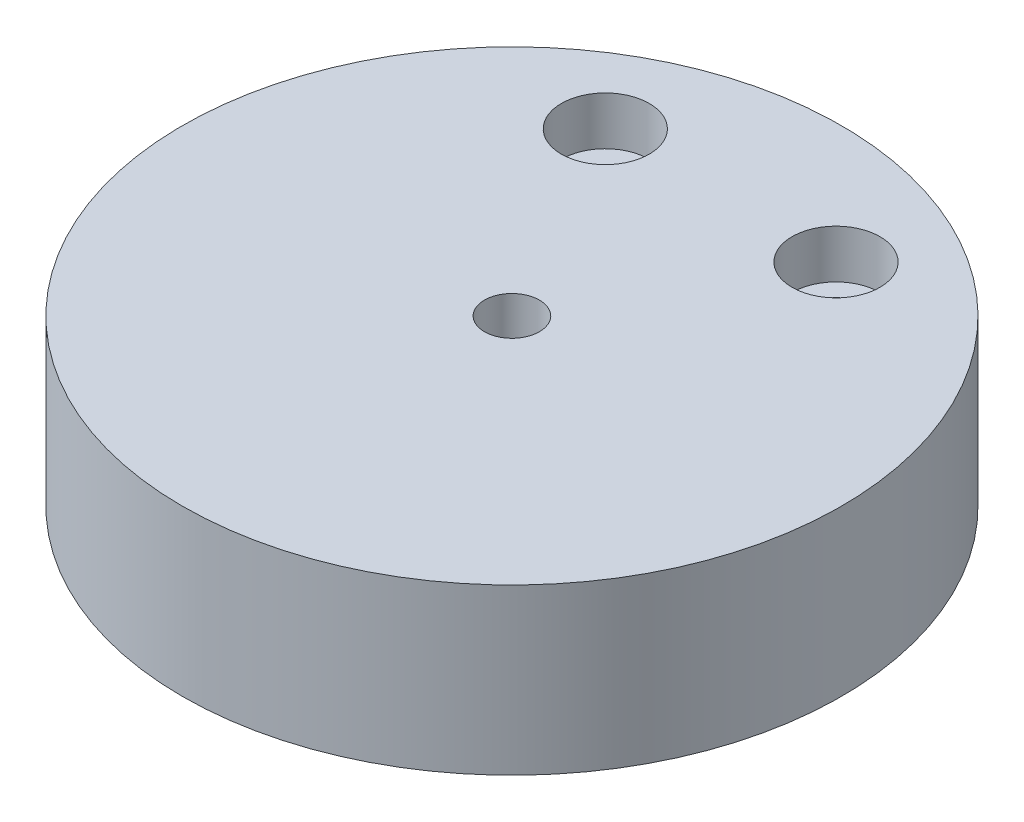
ISO-10303-21;
HEADER;
FILE_DESCRIPTION(('STEP AP214'),'2;1');
FILE_NAME('part.step','',(''),(''),'','','');
FILE_SCHEMA(('AUTOMOTIVE_DESIGN { 1 0 10303 214 1 1 1 1 }'));
ENDSEC;
DATA;
#1=APPLICATION_CONTEXT('core data for automotive mechanical design processes');
#2=APPLICATION_PROTOCOL_DEFINITION('international standard','automotive_design',2000,#1);
#3=PRODUCT_CONTEXT('',#1,'mechanical');
#4=PRODUCT('Part','Part','',(#3));
#5=PRODUCT_RELATED_PRODUCT_CATEGORY('part','',(#4));
#6=PRODUCT_DEFINITION_FORMATION('','',#4);
#7=PRODUCT_DEFINITION_CONTEXT('part definition',#1,'design');
#8=PRODUCT_DEFINITION('design','',#6,#7);
#9=PRODUCT_DEFINITION_SHAPE('','',#8);
#10=(LENGTH_UNIT() NAMED_UNIT(*) SI_UNIT(.MILLI.,.METRE.));
#11=(NAMED_UNIT(*) PLANE_ANGLE_UNIT() SI_UNIT($,.RADIAN.));
#12=(NAMED_UNIT(*) SI_UNIT($,.STERADIAN.) SOLID_ANGLE_UNIT());
#13=UNCERTAINTY_MEASURE_WITH_UNIT(LENGTH_MEASURE(1.E-05),#10,'distance_accuracy_value','');
#14=(GEOMETRIC_REPRESENTATION_CONTEXT(3) GLOBAL_UNCERTAINTY_ASSIGNED_CONTEXT((#13)) GLOBAL_UNIT_ASSIGNED_CONTEXT((#10,
#11,#12)) REPRESENTATION_CONTEXT('',''));
#15=CARTESIAN_POINT('',(0.,0.,0.));
#16=DIRECTION('',(0.,0.,1.));
#17=DIRECTION('',(1.,0.,0.));
#18=AXIS2_PLACEMENT_3D('',#15,#16,#17);
#19=CARTESIAN_POINT('',(121.722144348823,15.,-83.9358310413758));
#20=DIRECTION('',(0.,-1.,0.));
#21=DIRECTION('',(0.,0.,-1.));
#22=AXIS2_PLACEMENT_3D('',#19,#20,#21);
#23=CYLINDRICAL_SURFACE('',#22,30.);
#24=CARTESIAN_POINT('',(121.722144348823,15.,-83.9358310413758));
#25=DIRECTION('',(0.,1.,0.));
#26=DIRECTION('',(0.,0.,1.));
#27=AXIS2_PLACEMENT_3D('',#24,#25,#26);
#28=CIRCLE('',#27,30.);
#29=CARTESIAN_POINT('',(121.722144348823,15.,-53.9358310413758));
#30=VERTEX_POINT('',#29);
#31=EDGE_CURVE('E10',#30,#30,#28,.T.);
#32=ORIENTED_EDGE('',*,*,#31,.F.);
#33=EDGE_LOOP('',(#32));
#34=FACE_BOUND('',#33,.T.);
#35=CARTESIAN_POINT('',(121.722144348823,0.,-83.9358310413758));
#36=DIRECTION('',(0.,1.,0.));
#37=DIRECTION('',(0.,0.,1.));
#38=AXIS2_PLACEMENT_3D('',#35,#36,#37);
#39=CIRCLE('',#38,30.);
#40=CARTESIAN_POINT('',(121.722144348823,0.,-53.9358310413758));
#41=VERTEX_POINT('',#40);
#42=EDGE_CURVE('E36',#41,#41,#39,.T.);
#43=ORIENTED_EDGE('',*,*,#42,.T.);
#44=EDGE_LOOP('',(#43));
#45=FACE_BOUND('',#44,.T.);
#46=ADVANCED_FACE('F33',(#34,#45),#23,.T.);
#47=CARTESIAN_POINT('',(121.722144348823,15.,-83.9358310413758));
#48=DIRECTION('',(0.,1.,0.));
#49=DIRECTION('',(0.,0.,1.));
#50=AXIS2_PLACEMENT_3D('',#47,#48,#49);
#51=PLANE('',#50);
#52=CARTESIAN_POINT('',(132.222144348823,15.,-102.935831041376));
#53=DIRECTION('',(0.,1.,0.));
#54=DIRECTION('',(0.,0.,1.));
#55=AXIS2_PLACEMENT_3D('',#52,#53,#54);
#56=CIRCLE('',#55,4.);
#57=CARTESIAN_POINT('',(132.222144348823,15.,-98.9358310413758));
#58=VERTEX_POINT('',#57);
#59=EDGE_CURVE('E71',#58,#58,#56,.T.);
#60=ORIENTED_EDGE('',*,*,#59,.F.);
#61=EDGE_LOOP('',(#60));
#62=FACE_BOUND('',#61,.T.);
#63=CARTESIAN_POINT('',(111.222144348823,15.,-102.935831041376));
#64=DIRECTION('',(0.,1.,0.));
#65=DIRECTION('',(0.,0.,1.));
#66=AXIS2_PLACEMENT_3D('',#63,#64,#65);
#67=CIRCLE('',#66,3.99999999999999);
#68=CARTESIAN_POINT('',(111.222144348823,15.,-98.9358310413758));
#69=VERTEX_POINT('',#68);
#70=EDGE_CURVE('E59',#69,#69,#67,.T.);
#71=ORIENTED_EDGE('',*,*,#70,.F.);
#72=EDGE_LOOP('',(#71));
#73=FACE_BOUND('',#72,.T.);
#74=CARTESIAN_POINT('',(121.722144348823,15.,-83.9358310413758));
#75=DIRECTION('',(0.,1.,0.));
#76=DIRECTION('',(0.,0.,1.));
#77=AXIS2_PLACEMENT_3D('',#74,#75,#76);
#78=CIRCLE('',#77,2.50000000000001);
#79=CARTESIAN_POINT('',(121.722144348823,15.,-81.4358310413758));
#80=VERTEX_POINT('',#79);
#81=EDGE_CURVE('E45',#80,#80,#78,.T.);
#82=ORIENTED_EDGE('',*,*,#81,.F.);
#83=EDGE_LOOP('',(#82));
#84=FACE_BOUND('',#83,.T.);
#85=ORIENTED_EDGE('',*,*,#31,.T.);
#86=EDGE_LOOP('',(#85));
#87=FACE_BOUND('',#86,.T.);
#88=ADVANCED_FACE('F77',(#62,#73,#84,#87),#51,.T.);
#89=CARTESIAN_POINT('',(121.722144348823,0.,-83.9358310413758));
#90=DIRECTION('',(0.,1.,0.));
#91=DIRECTION('',(0.,0.,1.));
#92=AXIS2_PLACEMENT_3D('',#89,#90,#91);
#93=PLANE('',#92);
#94=CARTESIAN_POINT('',(132.222144348823,0.,-102.935831041376));
#95=DIRECTION('',(0.,1.,0.));
#96=DIRECTION('',(0.,0.,1.));
#97=AXIS2_PLACEMENT_3D('',#94,#95,#96);
#98=CIRCLE('',#97,2.25);
#99=CARTESIAN_POINT('',(132.222144348823,0.,-100.685831041376));
#100=VERTEX_POINT('',#99);
#101=EDGE_CURVE('E62',#100,#100,#98,.T.);
#102=ORIENTED_EDGE('',*,*,#101,.T.);
#103=EDGE_LOOP('',(#102));
#104=FACE_BOUND('',#103,.T.);
#105=CARTESIAN_POINT('',(111.222144348823,0.,-102.935831041376));
#106=DIRECTION('',(0.,1.,0.));
#107=DIRECTION('',(0.,0.,1.));
#108=AXIS2_PLACEMENT_3D('',#105,#106,#107);
#109=CIRCLE('',#108,2.25000000000001);
#110=CARTESIAN_POINT('',(111.222144348823,0.,-100.685831041376));
#111=VERTEX_POINT('',#110);
#112=EDGE_CURVE('E48',#111,#111,#109,.T.);
#113=ORIENTED_EDGE('',*,*,#112,.T.);
#114=EDGE_LOOP('',(#113));
#115=FACE_BOUND('',#114,.T.);
#116=CARTESIAN_POINT('',(121.722144348823,0.,-83.9358310413758));
#117=DIRECTION('',(0.,1.,0.));
#118=DIRECTION('',(0.,0.,1.));
#119=AXIS2_PLACEMENT_3D('',#116,#117,#118);
#120=CIRCLE('',#119,2.50000000000001);
#121=CARTESIAN_POINT('',(121.722144348823,0.,-81.4358310413758));
#122=VERTEX_POINT('',#121);
#123=EDGE_CURVE('E43',#122,#122,#120,.T.);
#124=ORIENTED_EDGE('',*,*,#123,.T.);
#125=EDGE_LOOP('',(#124));
#126=FACE_BOUND('',#125,.T.);
#127=ORIENTED_EDGE('',*,*,#42,.F.);
#128=EDGE_LOOP('',(#127));
#129=FACE_BOUND('',#128,.T.);
#130=ADVANCED_FACE('F80',(#104,#115,#126,#129),#93,.F.);
#131=CARTESIAN_POINT('',(121.722144348823,0.,-83.9358310413758));
#132=DIRECTION('',(0.,1.,0.));
#133=DIRECTION('',(0.,0.,1.));
#134=AXIS2_PLACEMENT_3D('',#131,#132,#133);
#135=CYLINDRICAL_SURFACE('',#134,2.50000000000001);
#136=ORIENTED_EDGE('',*,*,#123,.F.);
#137=EDGE_LOOP('',(#136));
#138=FACE_BOUND('',#137,.T.);
#139=ORIENTED_EDGE('',*,*,#81,.T.);
#140=EDGE_LOOP('',(#139));
#141=FACE_BOUND('',#140,.T.);
#142=ADVANCED_FACE('F86',(#138,#141),#135,.F.);
#143=CARTESIAN_POINT('',(111.222144348823,15.,-102.935831041376));
#144=DIRECTION('',(0.,1.,0.));
#145=DIRECTION('',(0.,0.,1.));
#146=AXIS2_PLACEMENT_3D('',#143,#144,#145);
#147=CYLINDRICAL_SURFACE('',#146,2.25000000000001);
#148=ORIENTED_EDGE('',*,*,#112,.F.);
#149=EDGE_LOOP('',(#148));
#150=FACE_BOUND('',#149,.T.);
#151=CARTESIAN_POINT('',(111.222144348823,10.6,-102.935831041376));
#152=DIRECTION('',(0.,1.,0.));
#153=DIRECTION('',(0.,0.,1.));
#154=AXIS2_PLACEMENT_3D('',#151,#152,#153);
#155=CIRCLE('',#154,2.25000000000002);
#156=CARTESIAN_POINT('',(111.222144348823,10.6,-100.685831041376));
#157=VERTEX_POINT('',#156);
#158=EDGE_CURVE('E53',#157,#157,#155,.T.);
#159=ORIENTED_EDGE('',*,*,#158,.T.);
#160=EDGE_LOOP('',(#159));
#161=FACE_BOUND('',#160,.T.);
#162=ADVANCED_FACE('F88',(#150,#161),#147,.F.);
#163=CARTESIAN_POINT('',(113.472144348823,10.6,-102.935831041376));
#164=DIRECTION('',(0.,-1.,0.));
#165=DIRECTION('',(0.,0.,-1.));
#166=AXIS2_PLACEMENT_3D('',#163,#164,#165);
#167=PLANE('',#166);
#168=ORIENTED_EDGE('',*,*,#158,.F.);
#169=EDGE_LOOP('',(#168));
#170=FACE_BOUND('',#169,.T.);
#171=CARTESIAN_POINT('',(111.222144348823,10.6,-102.935831041376));
#172=DIRECTION('',(0.,1.,0.));
#173=DIRECTION('',(0.,0.,1.));
#174=AXIS2_PLACEMENT_3D('',#171,#172,#173);
#175=CIRCLE('',#174,3.99999999999999);
#176=CARTESIAN_POINT('',(111.222144348823,10.6,-98.9358310413758));
#177=VERTEX_POINT('',#176);
#178=EDGE_CURVE('E56',#177,#177,#175,.T.);
#179=ORIENTED_EDGE('',*,*,#178,.T.);
#180=EDGE_LOOP('',(#179));
#181=FACE_BOUND('',#180,.T.);
#182=ADVANCED_FACE('F95',(#170,#181),#167,.F.);
#183=CARTESIAN_POINT('',(111.222144348823,15.,-102.935831041376));
#184=DIRECTION('',(0.,1.,0.));
#185=DIRECTION('',(0.,0.,1.));
#186=AXIS2_PLACEMENT_3D('',#183,#184,#185);
#187=CYLINDRICAL_SURFACE('',#186,3.99999999999999);
#188=ORIENTED_EDGE('',*,*,#178,.F.);
#189=EDGE_LOOP('',(#188));
#190=FACE_BOUND('',#189,.T.);
#191=ORIENTED_EDGE('',*,*,#70,.T.);
#192=EDGE_LOOP('',(#191));
#193=FACE_BOUND('',#192,.T.);
#194=ADVANCED_FACE('F131',(#190,#193),#187,.F.);
#195=CARTESIAN_POINT('',(132.222144348823,15.,-102.935831041376));
#196=DIRECTION('',(0.,1.,0.));
#197=DIRECTION('',(0.,0.,1.));
#198=AXIS2_PLACEMENT_3D('',#195,#196,#197);
#199=CYLINDRICAL_SURFACE('',#198,2.25);
#200=ORIENTED_EDGE('',*,*,#101,.F.);
#201=EDGE_LOOP('',(#200));
#202=FACE_BOUND('',#201,.T.);
#203=CARTESIAN_POINT('',(132.222144348823,10.6,-102.935831041376));
#204=DIRECTION('',(0.,1.,0.));
#205=DIRECTION('',(0.,0.,1.));
#206=AXIS2_PLACEMENT_3D('',#203,#204,#205);
#207=CIRCLE('',#206,2.25);
#208=CARTESIAN_POINT('',(132.222144348823,10.6,-100.685831041376));
#209=VERTEX_POINT('',#208);
#210=EDGE_CURVE('E65',#209,#209,#207,.T.);
#211=ORIENTED_EDGE('',*,*,#210,.T.);
#212=EDGE_LOOP('',(#211));
#213=FACE_BOUND('',#212,.T.);
#214=ADVANCED_FACE('F141',(#202,#213),#199,.F.);
#215=CARTESIAN_POINT('',(134.472144348823,10.6,-102.935831041376));
#216=DIRECTION('',(0.,-1.,0.));
#217=DIRECTION('',(0.,0.,-1.));
#218=AXIS2_PLACEMENT_3D('',#215,#216,#217);
#219=PLANE('',#218);
#220=ORIENTED_EDGE('',*,*,#210,.F.);
#221=EDGE_LOOP('',(#220));
#222=FACE_BOUND('',#221,.T.);
#223=CARTESIAN_POINT('',(132.222144348823,10.6,-102.935831041376));
#224=DIRECTION('',(0.,1.,0.));
#225=DIRECTION('',(0.,0.,1.));
#226=AXIS2_PLACEMENT_3D('',#223,#224,#225);
#227=CIRCLE('',#226,4.);
#228=CARTESIAN_POINT('',(132.222144348823,10.6,-98.9358310413758));
#229=VERTEX_POINT('',#228);
#230=EDGE_CURVE('E68',#229,#229,#227,.T.);
#231=ORIENTED_EDGE('',*,*,#230,.T.);
#232=EDGE_LOOP('',(#231));
#233=FACE_BOUND('',#232,.T.);
#234=ADVANCED_FACE('F151',(#222,#233),#219,.F.);
#235=CARTESIAN_POINT('',(132.222144348823,15.,-102.935831041376));
#236=DIRECTION('',(0.,1.,0.));
#237=DIRECTION('',(0.,0.,1.));
#238=AXIS2_PLACEMENT_3D('',#235,#236,#237);
#239=CYLINDRICAL_SURFACE('',#238,4.);
#240=ORIENTED_EDGE('',*,*,#230,.F.);
#241=EDGE_LOOP('',(#240));
#242=FACE_BOUND('',#241,.T.);
#243=ORIENTED_EDGE('',*,*,#59,.T.);
#244=EDGE_LOOP('',(#243));
#245=FACE_BOUND('',#244,.T.);
#246=ADVANCED_FACE('F75',(#242,#245),#239,.F.);
#247=CLOSED_SHELL('',(#46,#88,#130,#142,#162,#182,#194,#214,#234,#246));
#248=MANIFOLD_SOLID_BREP('B2',#247);
#249=ADVANCED_BREP_SHAPE_REPRESENTATION('',(#18,#248),#14);
#250=SHAPE_DEFINITION_REPRESENTATION(#9,#249);
ENDSEC;
END-ISO-10303-21;
